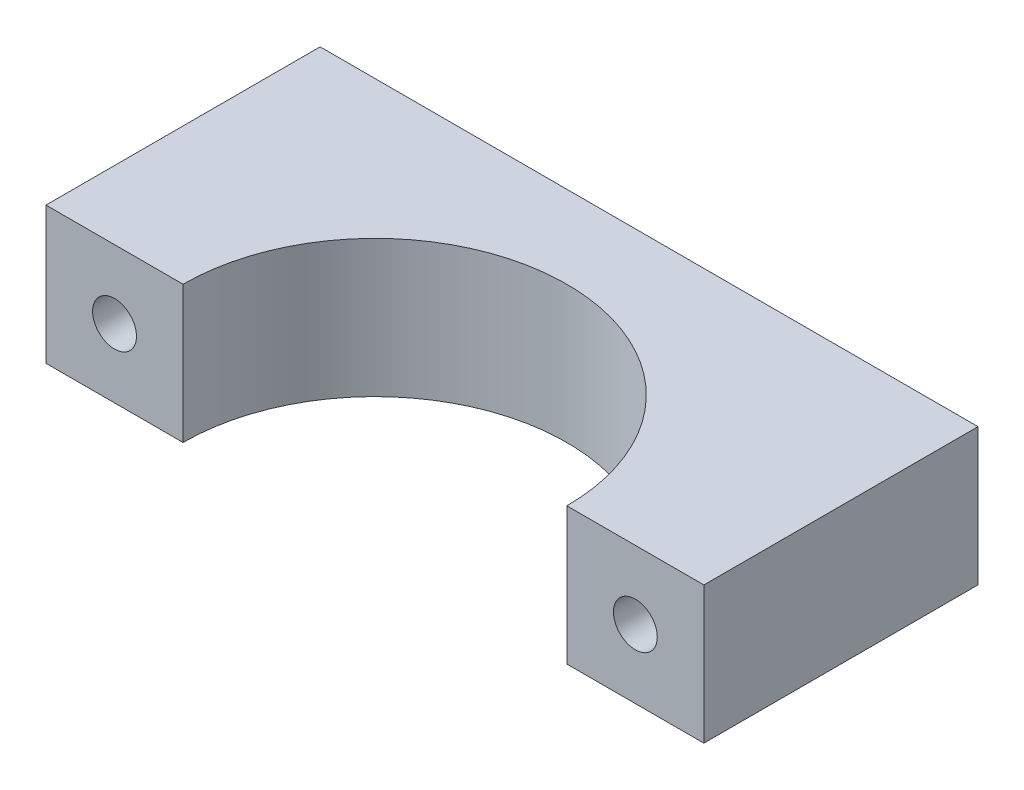
ISO-10303-21;
HEADER;
FILE_DESCRIPTION(('STEP AP214'),'2;1');
FILE_NAME('part.step','',(''),(''),'','','');
FILE_SCHEMA(('AUTOMOTIVE_DESIGN { 1 0 10303 214 1 1 1 1 }'));
ENDSEC;
DATA;
#1=APPLICATION_CONTEXT('core data for automotive mechanical design processes');
#2=APPLICATION_PROTOCOL_DEFINITION('international standard','automotive_design',2000,#1);
#3=PRODUCT_CONTEXT('',#1,'mechanical');
#4=PRODUCT('Part','Part','',(#3));
#5=PRODUCT_RELATED_PRODUCT_CATEGORY('part','',(#4));
#6=PRODUCT_DEFINITION_FORMATION('','',#4);
#7=PRODUCT_DEFINITION_CONTEXT('part definition',#1,'design');
#8=PRODUCT_DEFINITION('design','',#6,#7);
#9=PRODUCT_DEFINITION_SHAPE('','',#8);
#10=(LENGTH_UNIT() NAMED_UNIT(*) SI_UNIT(.MILLI.,.METRE.));
#11=(NAMED_UNIT(*) PLANE_ANGLE_UNIT() SI_UNIT($,.RADIAN.));
#12=(NAMED_UNIT(*) SI_UNIT($,.STERADIAN.) SOLID_ANGLE_UNIT());
#13=UNCERTAINTY_MEASURE_WITH_UNIT(LENGTH_MEASURE(1.E-05),#10,'distance_accuracy_value','');
#14=(GEOMETRIC_REPRESENTATION_CONTEXT(3) GLOBAL_UNCERTAINTY_ASSIGNED_CONTEXT((#13)) GLOBAL_UNIT_ASSIGNED_CONTEXT((#10,
#11,#12)) REPRESENTATION_CONTEXT('',''));
#15=CARTESIAN_POINT('',(0.,0.,0.));
#16=DIRECTION('',(0.,0.,1.));
#17=DIRECTION('',(1.,0.,0.));
#18=AXIS2_PLACEMENT_3D('',#15,#16,#17);
#19=CARTESIAN_POINT('',(-19.,5.,-19.));
#20=DIRECTION('',(0.,0.,1.));
#21=DIRECTION('',(1.,0.,0.));
#22=AXIS2_PLACEMENT_3D('',#19,#20,#21);
#23=CYLINDRICAL_SURFACE('',#22,1.6);
#24=CARTESIAN_POINT('',(-19.,5.,1.));
#25=DIRECTION('',(0.,0.,1.));
#26=DIRECTION('',(1.,0.,0.));
#27=AXIS2_PLACEMENT_3D('',#24,#25,#26);
#28=CIRCLE('',#27,1.6);
#29=CARTESIAN_POINT('',(-17.4,5.,1.));
#30=VERTEX_POINT('',#29);
#31=EDGE_CURVE('E125',#30,#30,#28,.T.);
#32=ORIENTED_EDGE('',*,*,#31,.T.);
#33=EDGE_LOOP('',(#32));
#34=FACE_BOUND('',#33,.T.);
#35=CARTESIAN_POINT('',(-19.,5.,-6.));
#36=DIRECTION('',(0.,0.,-1.));
#37=DIRECTION('',(-1.,0.,0.));
#38=AXIS2_PLACEMENT_3D('',#35,#36,#37);
#39=CIRCLE('',#38,1.6);
#40=CARTESIAN_POINT('',(-20.6,5.,-6.));
#41=VERTEX_POINT('',#40);
#42=EDGE_CURVE('E38',#41,#41,#39,.F.);
#43=ORIENTED_EDGE('',*,*,#42,.F.);
#44=EDGE_LOOP('',(#43));
#45=FACE_BOUND('',#44,.T.);
#46=ADVANCED_FACE('F34',(#34,#45),#23,.F.);
#47=CARTESIAN_POINT('',(19.,5.,-19.));
#48=DIRECTION('',(0.,0.,1.));
#49=DIRECTION('',(1.,0.,0.));
#50=AXIS2_PLACEMENT_3D('',#47,#48,#49);
#51=CYLINDRICAL_SURFACE('',#50,1.6);
#52=CARTESIAN_POINT('',(19.,5.,1.));
#53=DIRECTION('',(0.,0.,1.));
#54=DIRECTION('',(1.,0.,0.));
#55=AXIS2_PLACEMENT_3D('',#52,#53,#54);
#56=CIRCLE('',#55,1.6);
#57=CARTESIAN_POINT('',(20.6,5.,1.));
#58=VERTEX_POINT('',#57);
#59=EDGE_CURVE('E143',#58,#58,#56,.T.);
#60=ORIENTED_EDGE('',*,*,#59,.T.);
#61=EDGE_LOOP('',(#60));
#62=FACE_BOUND('',#61,.T.);
#63=CARTESIAN_POINT('',(19.,5.,-6.));
#64=DIRECTION('',(0.,0.,-1.));
#65=DIRECTION('',(-1.,0.,0.));
#66=AXIS2_PLACEMENT_3D('',#63,#64,#65);
#67=CIRCLE('',#66,1.6);
#68=CARTESIAN_POINT('',(17.4,5.,-6.));
#69=VERTEX_POINT('',#68);
#70=EDGE_CURVE('E137',#69,#69,#67,.F.);
#71=ORIENTED_EDGE('',*,*,#70,.F.);
#72=EDGE_LOOP('',(#71));
#73=FACE_BOUND('',#72,.T.);
#74=ADVANCED_FACE('F186',(#62,#73),#51,.F.);
#75=CARTESIAN_POINT('',(0.,10.,1.));
#76=DIRECTION('',(0.,-1.,0.));
#77=DIRECTION('',(0.,0.,-1.));
#78=AXIS2_PLACEMENT_3D('',#75,#76,#77);
#79=CYLINDRICAL_SURFACE('',#78,14.);
#80=CARTESIAN_POINT('',(0.,0.,1.));
#81=DIRECTION('',(0.,-1.,0.));
#82=DIRECTION('',(0.,0.,-1.));
#83=AXIS2_PLACEMENT_3D('',#80,#81,#82);
#84=CIRCLE('',#83,14.);
#85=CARTESIAN_POINT('',(-14.,0.,1.));
#86=VERTEX_POINT('',#85);
#87=CARTESIAN_POINT('',(14.,0.,1.));
#88=VERTEX_POINT('',#87);
#89=EDGE_CURVE('E121',#86,#88,#84,.T.);
#90=ORIENTED_EDGE('',*,*,#89,.T.);
#91=DIRECTION('',(0.,-1.,0.));
#92=VECTOR('',#91,1.);
#93=CARTESIAN_POINT('',(14.,10.,1.));
#94=LINE('',#93,#92);
#95=CARTESIAN_POINT('',(14.,10.,1.));
#96=VERTEX_POINT('',#95);
#97=EDGE_CURVE('E11',#96,#88,#94,.T.);
#98=ORIENTED_EDGE('',*,*,#97,.F.);
#99=CARTESIAN_POINT('',(0.,10.,1.));
#100=DIRECTION('',(0.,-1.,0.));
#101=DIRECTION('',(0.,0.,-1.));
#102=AXIS2_PLACEMENT_3D('',#99,#100,#101);
#103=CIRCLE('',#102,14.);
#104=CARTESIAN_POINT('',(-14.,10.,1.));
#105=VERTEX_POINT('',#104);
#106=EDGE_CURVE('E132',#105,#96,#103,.T.);
#107=ORIENTED_EDGE('',*,*,#106,.F.);
#108=DIRECTION('',(0.,-1.,0.));
#109=VECTOR('',#108,1.);
#110=CARTESIAN_POINT('',(-14.,10.,1.));
#111=LINE('',#110,#109);
#112=EDGE_CURVE('E117',#105,#86,#111,.T.);
#113=ORIENTED_EDGE('',*,*,#112,.T.);
#114=EDGE_LOOP('',(#90,#98,#107,#113));
#115=FACE_BOUND('',#114,.T.);
#116=ADVANCED_FACE('F36',(#115),#79,.F.);
#117=CARTESIAN_POINT('',(14.,10.,1.));
#118=DIRECTION('',(0.,0.,-1.));
#119=DIRECTION('',(-1.,0.,0.));
#120=AXIS2_PLACEMENT_3D('',#117,#118,#119);
#121=PLANE('',#120);
#122=ORIENTED_EDGE('',*,*,#59,.F.);
#123=EDGE_LOOP('',(#122));
#124=FACE_BOUND('',#123,.T.);
#125=DIRECTION('',(1.,0.,0.));
#126=VECTOR('',#125,1.);
#127=CARTESIAN_POINT('',(14.,0.,1.));
#128=LINE('',#127,#126);
#129=CARTESIAN_POINT('',(24.,0.,1.));
#130=VERTEX_POINT('',#129);
#131=EDGE_CURVE('E124',#88,#130,#128,.T.);
#132=ORIENTED_EDGE('',*,*,#131,.T.);
#133=DIRECTION('',(0.,-1.,0.));
#134=VECTOR('',#133,1.);
#135=CARTESIAN_POINT('',(24.,10.,1.));
#136=LINE('',#135,#134);
#137=CARTESIAN_POINT('',(24.,10.,1.));
#138=VERTEX_POINT('',#137);
#139=EDGE_CURVE('E44',#138,#130,#136,.T.);
#140=ORIENTED_EDGE('',*,*,#139,.F.);
#141=DIRECTION('',(1.,0.,0.));
#142=VECTOR('',#141,1.);
#143=CARTESIAN_POINT('',(14.,10.,1.));
#144=LINE('',#143,#142);
#145=EDGE_CURVE('E90',#96,#138,#144,.T.);
#146=ORIENTED_EDGE('',*,*,#145,.F.);
#147=ORIENTED_EDGE('',*,*,#97,.T.);
#148=EDGE_LOOP('',(#132,#140,#146,#147));
#149=FACE_BOUND('',#148,.T.);
#150=ADVANCED_FACE('F165',(#124,#149),#121,.F.);
#151=CARTESIAN_POINT('',(24.,10.,1.));
#152=DIRECTION('',(-1.,0.,0.));
#153=DIRECTION('',(0.,0.,1.));
#154=AXIS2_PLACEMENT_3D('',#151,#152,#153);
#155=PLANE('',#154);
#156=DIRECTION('',(0.,0.,-1.));
#157=VECTOR('',#156,1.);
#158=CARTESIAN_POINT('',(24.,0.,1.));
#159=LINE('',#158,#157);
#160=CARTESIAN_POINT('',(24.,0.,-19.));
#161=VERTEX_POINT('',#160);
#162=EDGE_CURVE('E127',#130,#161,#159,.T.);
#163=ORIENTED_EDGE('',*,*,#162,.T.);
#164=DIRECTION('',(0.,-1.,0.));
#165=VECTOR('',#164,1.);
#166=CARTESIAN_POINT('',(24.,10.,-19.));
#167=LINE('',#166,#165);
#168=CARTESIAN_POINT('',(24.,10.,-19.));
#169=VERTEX_POINT('',#168);
#170=EDGE_CURVE('E112',#169,#161,#167,.T.);
#171=ORIENTED_EDGE('',*,*,#170,.F.);
#172=DIRECTION('',(0.,0.,-1.));
#173=VECTOR('',#172,1.);
#174=CARTESIAN_POINT('',(24.,10.,1.));
#175=LINE('',#174,#173);
#176=EDGE_CURVE('E103',#138,#169,#175,.T.);
#177=ORIENTED_EDGE('',*,*,#176,.F.);
#178=ORIENTED_EDGE('',*,*,#139,.T.);
#179=EDGE_LOOP('',(#163,#171,#177,#178));
#180=FACE_BOUND('',#179,.T.);
#181=ADVANCED_FACE('F168',(#180),#155,.F.);
#182=CARTESIAN_POINT('',(24.,10.,-19.));
#183=DIRECTION('',(0.,0.,1.));
#184=DIRECTION('',(1.,0.,0.));
#185=AXIS2_PLACEMENT_3D('',#182,#183,#184);
#186=PLANE('',#185);
#187=CARTESIAN_POINT('',(19.,5.,-19.));
#188=DIRECTION('',(0.,0.,-1.));
#189=DIRECTION('',(-1.,0.,0.));
#190=AXIS2_PLACEMENT_3D('',#187,#188,#189);
#191=CIRCLE('',#190,3.);
#192=CARTESIAN_POINT('',(16.,5.,-19.));
#193=VERTEX_POINT('',#192);
#194=EDGE_CURVE('E145',#193,#193,#191,.T.);
#195=ORIENTED_EDGE('',*,*,#194,.F.);
#196=EDGE_LOOP('',(#195));
#197=FACE_BOUND('',#196,.T.);
#198=CARTESIAN_POINT('',(-19.,5.,-19.));
#199=DIRECTION('',(0.,0.,-1.));
#200=DIRECTION('',(-1.,0.,0.));
#201=AXIS2_PLACEMENT_3D('',#198,#199,#200);
#202=CIRCLE('',#201,3.);
#203=CARTESIAN_POINT('',(-22.,5.,-19.));
#204=VERTEX_POINT('',#203);
#205=EDGE_CURVE('E155',#204,#204,#202,.T.);
#206=ORIENTED_EDGE('',*,*,#205,.F.);
#207=EDGE_LOOP('',(#206));
#208=FACE_BOUND('',#207,.T.);
#209=DIRECTION('',(-1.,0.,0.));
#210=VECTOR('',#209,1.);
#211=CARTESIAN_POINT('',(24.,0.,-19.));
#212=LINE('',#211,#210);
#213=CARTESIAN_POINT('',(-24.,0.,-19.));
#214=VERTEX_POINT('',#213);
#215=EDGE_CURVE('E111',#161,#214,#212,.T.);
#216=ORIENTED_EDGE('',*,*,#215,.T.);
#217=DIRECTION('',(0.,-1.,0.));
#218=VECTOR('',#217,1.);
#219=CARTESIAN_POINT('',(-24.,10.,-19.));
#220=LINE('',#219,#218);
#221=CARTESIAN_POINT('',(-24.,10.,-19.));
#222=VERTEX_POINT('',#221);
#223=EDGE_CURVE('E108',#222,#214,#220,.T.);
#224=ORIENTED_EDGE('',*,*,#223,.F.);
#225=DIRECTION('',(-1.,0.,0.));
#226=VECTOR('',#225,1.);
#227=CARTESIAN_POINT('',(24.,10.,-19.));
#228=LINE('',#227,#226);
#229=EDGE_CURVE('E97',#169,#222,#228,.T.);
#230=ORIENTED_EDGE('',*,*,#229,.F.);
#231=ORIENTED_EDGE('',*,*,#170,.T.);
#232=EDGE_LOOP('',(#216,#224,#230,#231));
#233=FACE_BOUND('',#232,.T.);
#234=ADVANCED_FACE('F109',(#197,#208,#233),#186,.F.);
#235=CARTESIAN_POINT('',(-24.,10.,-19.));
#236=DIRECTION('',(1.,0.,0.));
#237=DIRECTION('',(0.,0.,-1.));
#238=AXIS2_PLACEMENT_3D('',#235,#236,#237);
#239=PLANE('',#238);
#240=DIRECTION('',(0.,0.,1.));
#241=VECTOR('',#240,1.);
#242=CARTESIAN_POINT('',(-24.,0.,-19.));
#243=LINE('',#242,#241);
#244=CARTESIAN_POINT('',(-24.,0.,1.));
#245=VERTEX_POINT('',#244);
#246=EDGE_CURVE('E76',#214,#245,#243,.T.);
#247=ORIENTED_EDGE('',*,*,#246,.T.);
#248=DIRECTION('',(0.,-1.,0.));
#249=VECTOR('',#248,1.);
#250=CARTESIAN_POINT('',(-24.,10.,1.));
#251=LINE('',#250,#249);
#252=CARTESIAN_POINT('',(-24.,10.,1.));
#253=VERTEX_POINT('',#252);
#254=EDGE_CURVE('E113',#253,#245,#251,.T.);
#255=ORIENTED_EDGE('',*,*,#254,.F.);
#256=DIRECTION('',(0.,0.,1.));
#257=VECTOR('',#256,1.);
#258=CARTESIAN_POINT('',(-24.,10.,-19.));
#259=LINE('',#258,#257);
#260=EDGE_CURVE('E101',#222,#253,#259,.T.);
#261=ORIENTED_EDGE('',*,*,#260,.F.);
#262=ORIENTED_EDGE('',*,*,#223,.T.);
#263=EDGE_LOOP('',(#247,#255,#261,#262));
#264=FACE_BOUND('',#263,.T.);
#265=ADVANCED_FACE('F115',(#264),#239,.F.);
#266=CARTESIAN_POINT('',(-24.,10.,1.));
#267=DIRECTION('',(0.,0.,-1.));
#268=DIRECTION('',(-1.,0.,0.));
#269=AXIS2_PLACEMENT_3D('',#266,#267,#268);
#270=PLANE('',#269);
#271=ORIENTED_EDGE('',*,*,#31,.F.);
#272=EDGE_LOOP('',(#271));
#273=FACE_BOUND('',#272,.T.);
#274=DIRECTION('',(1.,0.,0.));
#275=VECTOR('',#274,1.);
#276=CARTESIAN_POINT('',(-24.,0.,1.));
#277=LINE('',#276,#275);
#278=EDGE_CURVE('E82',#245,#86,#277,.T.);
#279=ORIENTED_EDGE('',*,*,#278,.T.);
#280=ORIENTED_EDGE('',*,*,#112,.F.);
#281=DIRECTION('',(1.,0.,0.));
#282=VECTOR('',#281,1.);
#283=CARTESIAN_POINT('',(-24.,10.,1.));
#284=LINE('',#283,#282);
#285=EDGE_CURVE('E53',#253,#105,#284,.T.);
#286=ORIENTED_EDGE('',*,*,#285,.F.);
#287=ORIENTED_EDGE('',*,*,#254,.T.);
#288=EDGE_LOOP('',(#279,#280,#286,#287));
#289=FACE_BOUND('',#288,.T.);
#290=ADVANCED_FACE('F173',(#273,#289),#270,.F.);
#291=CARTESIAN_POINT('',(0.,10.,1.));
#292=DIRECTION('',(0.,-1.,0.));
#293=DIRECTION('',(0.,0.,-1.));
#294=AXIS2_PLACEMENT_3D('',#291,#292,#293);
#295=PLANE('',#294);
#296=ORIENTED_EDGE('',*,*,#106,.T.);
#297=ORIENTED_EDGE('',*,*,#145,.T.);
#298=ORIENTED_EDGE('',*,*,#176,.T.);
#299=ORIENTED_EDGE('',*,*,#229,.T.);
#300=ORIENTED_EDGE('',*,*,#260,.T.);
#301=ORIENTED_EDGE('',*,*,#285,.T.);
#302=EDGE_LOOP('',(#296,#297,#298,#299,#300,#301));
#303=FACE_BOUND('',#302,.T.);
#304=ADVANCED_FACE('F99',(#303),#295,.F.);
#305=CARTESIAN_POINT('',(0.,0.,1.));
#306=DIRECTION('',(0.,-1.,0.));
#307=DIRECTION('',(0.,0.,-1.));
#308=AXIS2_PLACEMENT_3D('',#305,#306,#307);
#309=PLANE('',#308);
#310=ORIENTED_EDGE('',*,*,#89,.F.);
#311=ORIENTED_EDGE('',*,*,#278,.F.);
#312=ORIENTED_EDGE('',*,*,#246,.F.);
#313=ORIENTED_EDGE('',*,*,#215,.F.);
#314=ORIENTED_EDGE('',*,*,#162,.F.);
#315=ORIENTED_EDGE('',*,*,#131,.F.);
#316=EDGE_LOOP('',(#310,#311,#312,#313,#314,#315));
#317=FACE_BOUND('',#316,.T.);
#318=ADVANCED_FACE('F171',(#317),#309,.T.);
#319=CARTESIAN_POINT('',(19.,5.,-6.));
#320=DIRECTION('',(0.,0.,-1.));
#321=DIRECTION('',(-1.,0.,0.));
#322=AXIS2_PLACEMENT_3D('',#319,#320,#321);
#323=PLANE('',#322);
#324=CARTESIAN_POINT('',(19.,5.,-6.));
#325=DIRECTION('',(0.,0.,-1.));
#326=DIRECTION('',(-1.,0.,0.));
#327=AXIS2_PLACEMENT_3D('',#324,#325,#326);
#328=CIRCLE('',#327,3.);
#329=CARTESIAN_POINT('',(16.,5.,-6.));
#330=VERTEX_POINT('',#329);
#331=EDGE_CURVE('E139',#330,#330,#328,.T.);
#332=ORIENTED_EDGE('',*,*,#331,.T.);
#333=EDGE_LOOP('',(#332));
#334=FACE_BOUND('',#333,.T.);
#335=ORIENTED_EDGE('',*,*,#70,.T.);
#336=EDGE_LOOP('',(#335));
#337=FACE_BOUND('',#336,.T.);
#338=ADVANCED_FACE('F199',(#334,#337),#323,.T.);
#339=CARTESIAN_POINT('',(19.,5.,-6.));
#340=DIRECTION('',(0.,0.,-1.));
#341=DIRECTION('',(-1.,0.,0.));
#342=AXIS2_PLACEMENT_3D('',#339,#340,#341);
#343=CYLINDRICAL_SURFACE('',#342,3.);
#344=ORIENTED_EDGE('',*,*,#331,.F.);
#345=EDGE_LOOP('',(#344));
#346=FACE_BOUND('',#345,.T.);
#347=ORIENTED_EDGE('',*,*,#194,.T.);
#348=EDGE_LOOP('',(#347));
#349=FACE_BOUND('',#348,.T.);
#350=ADVANCED_FACE('F203',(#346,#349),#343,.F.);
#351=CARTESIAN_POINT('',(-19.,5.,-6.));
#352=DIRECTION('',(0.,0.,-1.));
#353=DIRECTION('',(-1.,0.,0.));
#354=AXIS2_PLACEMENT_3D('',#351,#352,#353);
#355=PLANE('',#354);
#356=CARTESIAN_POINT('',(-19.,5.,-6.));
#357=DIRECTION('',(0.,0.,-1.));
#358=DIRECTION('',(-1.,0.,0.));
#359=AXIS2_PLACEMENT_3D('',#356,#357,#358);
#360=CIRCLE('',#359,3.);
#361=CARTESIAN_POINT('',(-22.,5.,-6.));
#362=VERTEX_POINT('',#361);
#363=EDGE_CURVE('E150',#362,#362,#360,.T.);
#364=ORIENTED_EDGE('',*,*,#363,.T.);
#365=EDGE_LOOP('',(#364));
#366=FACE_BOUND('',#365,.T.);
#367=ORIENTED_EDGE('',*,*,#42,.T.);
#368=EDGE_LOOP('',(#367));
#369=FACE_BOUND('',#368,.T.);
#370=ADVANCED_FACE('F208',(#366,#369),#355,.T.);
#371=CARTESIAN_POINT('',(-19.,5.,-6.));
#372=DIRECTION('',(0.,0.,-1.));
#373=DIRECTION('',(-1.,0.,0.));
#374=AXIS2_PLACEMENT_3D('',#371,#372,#373);
#375=CYLINDRICAL_SURFACE('',#374,3.);
#376=ORIENTED_EDGE('',*,*,#363,.F.);
#377=EDGE_LOOP('',(#376));
#378=FACE_BOUND('',#377,.T.);
#379=ORIENTED_EDGE('',*,*,#205,.T.);
#380=EDGE_LOOP('',(#379));
#381=FACE_BOUND('',#380,.T.);
#382=ADVANCED_FACE('F196',(#378,#381),#375,.F.);
#383=CLOSED_SHELL('',(#46,#74,#116,#150,#181,#234,#265,#290,#304,#318,#338,#350,#370,#382));
#384=MANIFOLD_SOLID_BREP('B2',#383);
#385=ADVANCED_BREP_SHAPE_REPRESENTATION('',(#18,#384),#14);
#386=SHAPE_DEFINITION_REPRESENTATION(#9,#385);
ENDSEC;
END-ISO-10303-21;
